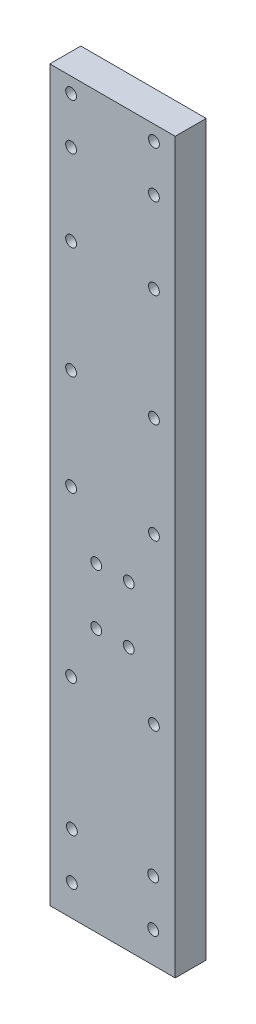
ISO-10303-21;
HEADER;
FILE_DESCRIPTION(('STEP AP214'),'2;1');
FILE_NAME('part.step','',(''),(''),'','','');
FILE_SCHEMA(('AUTOMOTIVE_DESIGN { 1 0 10303 214 1 1 1 1 }'));
ENDSEC;
DATA;
#1=APPLICATION_CONTEXT('core data for automotive mechanical design processes');
#2=APPLICATION_PROTOCOL_DEFINITION('international standard','automotive_design',2000,#1);
#3=PRODUCT_CONTEXT('',#1,'mechanical');
#4=PRODUCT('Part','Part','',(#3));
#5=PRODUCT_RELATED_PRODUCT_CATEGORY('part','',(#4));
#6=PRODUCT_DEFINITION_FORMATION('','',#4);
#7=PRODUCT_DEFINITION_CONTEXT('part definition',#1,'design');
#8=PRODUCT_DEFINITION('design','',#6,#7);
#9=PRODUCT_DEFINITION_SHAPE('','',#8);
#10=(LENGTH_UNIT() NAMED_UNIT(*) SI_UNIT(.MILLI.,.METRE.));
#11=(NAMED_UNIT(*) PLANE_ANGLE_UNIT() SI_UNIT($,.RADIAN.));
#12=(NAMED_UNIT(*) SI_UNIT($,.STERADIAN.) SOLID_ANGLE_UNIT());
#13=UNCERTAINTY_MEASURE_WITH_UNIT(LENGTH_MEASURE(1.E-05),#10,'distance_accuracy_value','');
#14=(GEOMETRIC_REPRESENTATION_CONTEXT(3) GLOBAL_UNCERTAINTY_ASSIGNED_CONTEXT((#13)) GLOBAL_UNIT_ASSIGNED_CONTEXT((#10,
#11,#12)) REPRESENTATION_CONTEXT('',''));
#15=CARTESIAN_POINT('',(0.,0.,0.));
#16=DIRECTION('',(0.,0.,1.));
#17=DIRECTION('',(1.,0.,0.));
#18=AXIS2_PLACEMENT_3D('',#15,#16,#17);
#19=CARTESIAN_POINT('',(0.,0.,4.));
#20=DIRECTION('',(0.,0.,-1.));
#21=DIRECTION('',(-1.,0.,0.));
#22=AXIS2_PLACEMENT_3D('',#19,#20,#21);
#23=PLANE('',#22);
#24=CARTESIAN_POINT('',(2.7500000000009,92.0614488310554,4.));
#25=DIRECTION('',(0.,0.,1.));
#26=DIRECTION('',(-1.,0.,0.));
#27=AXIS2_PLACEMENT_3D('',#24,#25,#26);
#28=CIRCLE('',#27,0.700000000000009);
#29=CARTESIAN_POINT('',(2.05000000000089,92.0614488310554,4.));
#30=VERTEX_POINT('',#29);
#31=EDGE_CURVE('E217',#30,#30,#28,.T.);
#32=ORIENTED_EDGE('',*,*,#31,.F.);
#33=EDGE_LOOP('',(#32));
#34=FACE_BOUND('',#33,.T.);
#35=CARTESIAN_POINT('',(13.4500000000022,86.0614488310554,4.));
#36=DIRECTION('',(0.,0.,1.));
#37=DIRECTION('',(1.,0.,0.));
#38=AXIS2_PLACEMENT_3D('',#35,#36,#37);
#39=CIRCLE('',#38,0.70000000000001);
#40=CARTESIAN_POINT('',(14.1500000000022,86.0614488310554,4.));
#41=VERTEX_POINT('',#40);
#42=EDGE_CURVE('E205',#41,#41,#39,.T.);
#43=ORIENTED_EDGE('',*,*,#42,.F.);
#44=EDGE_LOOP('',(#43));
#45=FACE_BOUND('',#44,.T.);
#46=CARTESIAN_POINT('',(13.4500000000001,75.5614488310554,4.));
#47=DIRECTION('',(0.,0.,1.));
#48=DIRECTION('',(1.,0.,0.));
#49=AXIS2_PLACEMENT_3D('',#46,#47,#48);
#50=CIRCLE('',#49,0.70000000000001);
#51=CARTESIAN_POINT('',(14.1500000000001,75.5614488310554,4.));
#52=VERTEX_POINT('',#51);
#53=EDGE_CURVE('E193',#52,#52,#50,.T.);
#54=ORIENTED_EDGE('',*,*,#53,.F.);
#55=EDGE_LOOP('',(#54));
#56=FACE_BOUND('',#55,.T.);
#57=CARTESIAN_POINT('',(13.350000000001,3.84644883105539,4.));
#58=DIRECTION('',(0.,0.,1.));
#59=DIRECTION('',(-1.,0.,0.));
#60=AXIS2_PLACEMENT_3D('',#57,#58,#59);
#61=CIRCLE('',#60,0.7);
#62=CARTESIAN_POINT('',(12.650000000001,3.84644883105539,4.));
#63=VERTEX_POINT('',#62);
#64=EDGE_CURVE('E181',#63,#63,#61,.T.);
#65=ORIENTED_EDGE('',*,*,#64,.F.);
#66=EDGE_LOOP('',(#65));
#67=FACE_BOUND('',#66,.T.);
#68=CARTESIAN_POINT('',(2.84999999999999,3.84644883105539,4.));
#69=DIRECTION('',(0.,0.,1.));
#70=DIRECTION('',(1.,0.,0.));
#71=AXIS2_PLACEMENT_3D('',#68,#69,#70);
#72=CIRCLE('',#71,0.7);
#73=CARTESIAN_POINT('',(3.54999999999999,3.84644883105539,4.));
#74=VERTEX_POINT('',#73);
#75=EDGE_CURVE('E169',#74,#74,#72,.T.);
#76=ORIENTED_EDGE('',*,*,#75,.F.);
#77=EDGE_LOOP('',(#76));
#78=FACE_BOUND('',#77,.T.);
#79=CARTESIAN_POINT('',(2.85,9.84644883105539,4.));
#80=DIRECTION('',(0.,0.,1.));
#81=DIRECTION('',(1.,0.,0.));
#82=AXIS2_PLACEMENT_3D('',#79,#80,#81);
#83=CIRCLE('',#82,0.7);
#84=CARTESIAN_POINT('',(3.55,9.84644883105539,4.));
#85=VERTEX_POINT('',#84);
#86=EDGE_CURVE('E157',#85,#85,#83,.T.);
#87=ORIENTED_EDGE('',*,*,#86,.F.);
#88=EDGE_LOOP('',(#87));
#89=FACE_BOUND('',#88,.T.);
#90=CARTESIAN_POINT('',(13.4500000000001,48.1064488310554,4.));
#91=DIRECTION('',(0.,0.,1.));
#92=DIRECTION('',(1.,0.,0.));
#93=AXIS2_PLACEMENT_3D('',#90,#91,#92);
#94=CIRCLE('',#93,0.699999999999999);
#95=CARTESIAN_POINT('',(14.1500000000001,48.1064488310554,4.));
#96=VERTEX_POINT('',#95);
#97=EDGE_CURVE('E145',#96,#96,#94,.T.);
#98=ORIENTED_EDGE('',*,*,#97,.F.);
#99=EDGE_LOOP('',(#98));
#100=FACE_BOUND('',#99,.T.);
#101=CARTESIAN_POINT('',(13.4500000000001,26.8464488310553,4.));
#102=DIRECTION('',(0.,0.,1.));
#103=DIRECTION('',(1.,0.,0.));
#104=AXIS2_PLACEMENT_3D('',#101,#102,#103);
#105=CIRCLE('',#104,0.699999999999999);
#106=CARTESIAN_POINT('',(14.1500000000001,26.8464488310553,4.));
#107=VERTEX_POINT('',#106);
#108=EDGE_CURVE('E133',#107,#107,#105,.T.);
#109=ORIENTED_EDGE('',*,*,#108,.F.);
#110=EDGE_LOOP('',(#109));
#111=FACE_BOUND('',#110,.T.);
#112=CARTESIAN_POINT('',(10.2000000000001,33.846448831055,4.));
#113=DIRECTION('',(0.,0.,1.));
#114=DIRECTION('',(1.,0.,0.));
#115=AXIS2_PLACEMENT_3D('',#112,#113,#114);
#116=CIRCLE('',#115,0.699999999999999);
#117=CARTESIAN_POINT('',(10.9000000000001,33.846448831055,4.));
#118=VERTEX_POINT('',#117);
#119=EDGE_CURVE('E121',#118,#118,#116,.T.);
#120=ORIENTED_EDGE('',*,*,#119,.F.);
#121=EDGE_LOOP('',(#120));
#122=FACE_BOUND('',#121,.T.);
#123=CARTESIAN_POINT('',(10.2000000000001,41.1664488310547,4.));
#124=DIRECTION('',(0.,0.,1.));
#125=DIRECTION('',(1.,0.,0.));
#126=AXIS2_PLACEMENT_3D('',#123,#124,#125);
#127=CIRCLE('',#126,0.699999999999999);
#128=CARTESIAN_POINT('',(10.9000000000001,41.1664488310547,4.));
#129=VERTEX_POINT('',#128);
#130=EDGE_CURVE('E100',#129,#129,#127,.T.);
#131=ORIENTED_EDGE('',*,*,#130,.F.);
#132=EDGE_LOOP('',(#131));
#133=FACE_BOUND('',#132,.T.);
#134=DIRECTION('',(1.,0.,0.));
#135=VECTOR('',#134,1.);
#136=CARTESIAN_POINT('',(0.,-0.15355116894461,4.));
#137=LINE('',#136,#135);
#138=CARTESIAN_POINT('',(0.,-0.15355116894461,4.));
#139=VERTEX_POINT('',#138);
#140=CARTESIAN_POINT('',(16.2,-0.15355116894461,4.));
#141=VERTEX_POINT('',#140);
#142=EDGE_CURVE('E85',#139,#141,#137,.T.);
#143=ORIENTED_EDGE('',*,*,#142,.T.);
#144=DIRECTION('',(0.,1.,0.));
#145=VECTOR('',#144,1.);
#146=CARTESIAN_POINT('',(16.2,94.0064488310554,4.));
#147=LINE('',#146,#145);
#148=CARTESIAN_POINT('',(16.2,94.0064488310554,4.));
#149=VERTEX_POINT('',#148);
#150=EDGE_CURVE('E80',#141,#149,#147,.T.);
#151=ORIENTED_EDGE('',*,*,#150,.T.);
#152=DIRECTION('',(-1.,0.,0.));
#153=VECTOR('',#152,1.);
#154=CARTESIAN_POINT('',(0.,94.0064488310554,4.));
#155=LINE('',#154,#153);
#156=CARTESIAN_POINT('',(0.,94.0064488310554,4.));
#157=VERTEX_POINT('',#156);
#158=EDGE_CURVE('E83',#149,#157,#155,.T.);
#159=ORIENTED_EDGE('',*,*,#158,.T.);
#160=DIRECTION('',(0.,-1.,0.));
#161=VECTOR('',#160,1.);
#162=CARTESIAN_POINT('',(0.,94.0064488310554,4.));
#163=LINE('',#162,#161);
#164=EDGE_CURVE('E50',#157,#139,#163,.T.);
#165=ORIENTED_EDGE('',*,*,#164,.T.);
#166=EDGE_LOOP('',(#143,#151,#159,#165));
#167=FACE_BOUND('',#166,.T.);
#168=CARTESIAN_POINT('',(6.,41.1064488310554,4.));
#169=DIRECTION('',(0.,0.,1.));
#170=DIRECTION('',(1.,0.,0.));
#171=AXIS2_PLACEMENT_3D('',#168,#169,#170);
#172=CIRCLE('',#171,0.699999999999999);
#173=CARTESIAN_POINT('',(6.7,41.1064488310554,4.));
#174=VERTEX_POINT('',#173);
#175=EDGE_CURVE('E115',#174,#174,#172,.T.);
#176=ORIENTED_EDGE('',*,*,#175,.F.);
#177=EDGE_LOOP('',(#176));
#178=FACE_BOUND('',#177,.T.);
#179=CARTESIAN_POINT('',(6.,33.846448831055,4.));
#180=DIRECTION('',(0.,0.,1.));
#181=DIRECTION('',(1.,0.,0.));
#182=AXIS2_PLACEMENT_3D('',#179,#180,#181);
#183=CIRCLE('',#182,0.7);
#184=CARTESIAN_POINT('',(6.7,33.846448831055,4.));
#185=VERTEX_POINT('',#184);
#186=EDGE_CURVE('E127',#185,#185,#183,.T.);
#187=ORIENTED_EDGE('',*,*,#186,.F.);
#188=EDGE_LOOP('',(#187));
#189=FACE_BOUND('',#188,.T.);
#190=CARTESIAN_POINT('',(2.75000000000002,26.8464488310555,4.));
#191=DIRECTION('',(0.,0.,1.));
#192=DIRECTION('',(1.,0.,0.));
#193=AXIS2_PLACEMENT_3D('',#190,#191,#192);
#194=CIRCLE('',#193,0.7);
#195=CARTESIAN_POINT('',(3.45000000000002,26.8464488310555,4.));
#196=VERTEX_POINT('',#195);
#197=EDGE_CURVE('E139',#196,#196,#194,.T.);
#198=ORIENTED_EDGE('',*,*,#197,.F.);
#199=EDGE_LOOP('',(#198));
#200=FACE_BOUND('',#199,.T.);
#201=CARTESIAN_POINT('',(2.75000000000002,48.1064488310554,4.));
#202=DIRECTION('',(0.,0.,1.));
#203=DIRECTION('',(1.,0.,0.));
#204=AXIS2_PLACEMENT_3D('',#201,#202,#203);
#205=CIRCLE('',#204,0.699999999999999);
#206=CARTESIAN_POINT('',(3.45000000000002,48.1064488310554,4.));
#207=VERTEX_POINT('',#206);
#208=EDGE_CURVE('E151',#207,#207,#205,.T.);
#209=ORIENTED_EDGE('',*,*,#208,.F.);
#210=EDGE_LOOP('',(#209));
#211=FACE_BOUND('',#210,.T.);
#212=CARTESIAN_POINT('',(13.4500000000016,61.1064488310554,4.));
#213=DIRECTION('',(0.,0.,1.));
#214=DIRECTION('',(1.,0.,0.));
#215=AXIS2_PLACEMENT_3D('',#212,#213,#214);
#216=CIRCLE('',#215,0.700000000000004);
#217=CARTESIAN_POINT('',(14.1500000000016,61.1064488310554,4.));
#218=VERTEX_POINT('',#217);
#219=EDGE_CURVE('E163',#218,#218,#216,.T.);
#220=ORIENTED_EDGE('',*,*,#219,.F.);
#221=EDGE_LOOP('',(#220));
#222=FACE_BOUND('',#221,.T.);
#223=CARTESIAN_POINT('',(13.350000000001,9.84644883105539,4.));
#224=DIRECTION('',(0.,0.,1.));
#225=DIRECTION('',(-1.,0.,0.));
#226=AXIS2_PLACEMENT_3D('',#223,#224,#225);
#227=CIRCLE('',#226,0.699999999999999);
#228=CARTESIAN_POINT('',(12.650000000001,9.84644883105539,4.));
#229=VERTEX_POINT('',#228);
#230=EDGE_CURVE('E175',#229,#229,#227,.T.);
#231=ORIENTED_EDGE('',*,*,#230,.F.);
#232=EDGE_LOOP('',(#231));
#233=FACE_BOUND('',#232,.T.);
#234=CARTESIAN_POINT('',(2.75000000000136,61.1064488310554,4.));
#235=DIRECTION('',(0.,0.,1.));
#236=DIRECTION('',(1.,0.,0.));
#237=AXIS2_PLACEMENT_3D('',#234,#235,#236);
#238=CIRCLE('',#237,0.700000000000004);
#239=CARTESIAN_POINT('',(3.45000000000136,61.1064488310554,4.));
#240=VERTEX_POINT('',#239);
#241=EDGE_CURVE('E187',#240,#240,#238,.T.);
#242=ORIENTED_EDGE('',*,*,#241,.F.);
#243=EDGE_LOOP('',(#242));
#244=FACE_BOUND('',#243,.T.);
#245=CARTESIAN_POINT('',(2.75000000000002,75.5614488310554,4.));
#246=DIRECTION('',(0.,0.,1.));
#247=DIRECTION('',(1.,0.,0.));
#248=AXIS2_PLACEMENT_3D('',#245,#246,#247);
#249=CIRCLE('',#248,0.700000000000009);
#250=CARTESIAN_POINT('',(3.45000000000003,75.5614488310554,4.));
#251=VERTEX_POINT('',#250);
#252=EDGE_CURVE('E199',#251,#251,#249,.T.);
#253=ORIENTED_EDGE('',*,*,#252,.F.);
#254=EDGE_LOOP('',(#253));
#255=FACE_BOUND('',#254,.T.);
#256=CARTESIAN_POINT('',(2.7500000000009,86.0614488310554,4.));
#257=DIRECTION('',(0.,0.,1.));
#258=DIRECTION('',(1.,0.,0.));
#259=AXIS2_PLACEMENT_3D('',#256,#257,#258);
#260=CIRCLE('',#259,0.700000000000009);
#261=CARTESIAN_POINT('',(3.45000000000091,86.0614488310554,4.));
#262=VERTEX_POINT('',#261);
#263=EDGE_CURVE('E211',#262,#262,#260,.T.);
#264=ORIENTED_EDGE('',*,*,#263,.F.);
#265=EDGE_LOOP('',(#264));
#266=FACE_BOUND('',#265,.T.);
#267=CARTESIAN_POINT('',(13.4500000000022,92.0614488310554,4.));
#268=DIRECTION('',(0.,0.,1.));
#269=DIRECTION('',(-1.,0.,0.));
#270=AXIS2_PLACEMENT_3D('',#267,#268,#269);
#271=CIRCLE('',#270,0.70000000000001);
#272=CARTESIAN_POINT('',(12.7500000000022,92.0614488310554,4.));
#273=VERTEX_POINT('',#272);
#274=EDGE_CURVE('E223',#273,#273,#271,.T.);
#275=ORIENTED_EDGE('',*,*,#274,.F.);
#276=EDGE_LOOP('',(#275));
#277=FACE_BOUND('',#276,.T.);
#278=ADVANCED_FACE('F33',(#34,#45,#56,#67,#78,#89,#100,#111,#122,#133,#167,#178,#189,#200,#211,
#222,#233,#244,#255,#266,#277),#23,.F.);
#279=CARTESIAN_POINT('',(0.,0.,0.));
#280=DIRECTION('',(0.,0.,-1.));
#281=DIRECTION('',(-1.,0.,0.));
#282=AXIS2_PLACEMENT_3D('',#279,#280,#281);
#283=PLANE('',#282);
#284=CARTESIAN_POINT('',(2.7500000000009,92.0614488310554,0.));
#285=DIRECTION('',(0.,0.,1.));
#286=DIRECTION('',(-1.,0.,0.));
#287=AXIS2_PLACEMENT_3D('',#284,#285,#286);
#288=CIRCLE('',#287,0.700000000000009);
#289=CARTESIAN_POINT('',(2.05000000000089,92.0614488310554,0.));
#290=VERTEX_POINT('',#289);
#291=EDGE_CURVE('E220',#290,#290,#288,.T.);
#292=ORIENTED_EDGE('',*,*,#291,.T.);
#293=EDGE_LOOP('',(#292));
#294=FACE_BOUND('',#293,.T.);
#295=CARTESIAN_POINT('',(13.4500000000022,86.0614488310554,0.));
#296=DIRECTION('',(0.,0.,1.));
#297=DIRECTION('',(1.,0.,0.));
#298=AXIS2_PLACEMENT_3D('',#295,#296,#297);
#299=CIRCLE('',#298,0.70000000000001);
#300=CARTESIAN_POINT('',(14.1500000000022,86.0614488310554,0.));
#301=VERTEX_POINT('',#300);
#302=EDGE_CURVE('E208',#301,#301,#299,.T.);
#303=ORIENTED_EDGE('',*,*,#302,.T.);
#304=EDGE_LOOP('',(#303));
#305=FACE_BOUND('',#304,.T.);
#306=CARTESIAN_POINT('',(13.4500000000001,75.5614488310554,0.));
#307=DIRECTION('',(0.,0.,1.));
#308=DIRECTION('',(1.,0.,0.));
#309=AXIS2_PLACEMENT_3D('',#306,#307,#308);
#310=CIRCLE('',#309,0.70000000000001);
#311=CARTESIAN_POINT('',(14.1500000000001,75.5614488310554,0.));
#312=VERTEX_POINT('',#311);
#313=EDGE_CURVE('E196',#312,#312,#310,.T.);
#314=ORIENTED_EDGE('',*,*,#313,.T.);
#315=EDGE_LOOP('',(#314));
#316=FACE_BOUND('',#315,.T.);
#317=CARTESIAN_POINT('',(13.350000000001,3.84644883105539,0.));
#318=DIRECTION('',(0.,0.,1.));
#319=DIRECTION('',(-1.,0.,0.));
#320=AXIS2_PLACEMENT_3D('',#317,#318,#319);
#321=CIRCLE('',#320,0.7);
#322=CARTESIAN_POINT('',(12.650000000001,3.84644883105539,0.));
#323=VERTEX_POINT('',#322);
#324=EDGE_CURVE('E184',#323,#323,#321,.T.);
#325=ORIENTED_EDGE('',*,*,#324,.T.);
#326=EDGE_LOOP('',(#325));
#327=FACE_BOUND('',#326,.T.);
#328=CARTESIAN_POINT('',(2.84999999999999,3.84644883105539,0.));
#329=DIRECTION('',(0.,0.,1.));
#330=DIRECTION('',(1.,0.,0.));
#331=AXIS2_PLACEMENT_3D('',#328,#329,#330);
#332=CIRCLE('',#331,0.7);
#333=CARTESIAN_POINT('',(3.54999999999999,3.84644883105539,0.));
#334=VERTEX_POINT('',#333);
#335=EDGE_CURVE('E172',#334,#334,#332,.T.);
#336=ORIENTED_EDGE('',*,*,#335,.T.);
#337=EDGE_LOOP('',(#336));
#338=FACE_BOUND('',#337,.T.);
#339=CARTESIAN_POINT('',(2.85,9.84644883105539,0.));
#340=DIRECTION('',(0.,0.,1.));
#341=DIRECTION('',(1.,0.,0.));
#342=AXIS2_PLACEMENT_3D('',#339,#340,#341);
#343=CIRCLE('',#342,0.7);
#344=CARTESIAN_POINT('',(3.55,9.84644883105539,0.));
#345=VERTEX_POINT('',#344);
#346=EDGE_CURVE('E160',#345,#345,#343,.T.);
#347=ORIENTED_EDGE('',*,*,#346,.T.);
#348=EDGE_LOOP('',(#347));
#349=FACE_BOUND('',#348,.T.);
#350=CARTESIAN_POINT('',(13.4500000000001,48.1064488310554,0.));
#351=DIRECTION('',(0.,0.,1.));
#352=DIRECTION('',(1.,0.,0.));
#353=AXIS2_PLACEMENT_3D('',#350,#351,#352);
#354=CIRCLE('',#353,0.699999999999999);
#355=CARTESIAN_POINT('',(14.1500000000001,48.1064488310554,0.));
#356=VERTEX_POINT('',#355);
#357=EDGE_CURVE('E148',#356,#356,#354,.T.);
#358=ORIENTED_EDGE('',*,*,#357,.T.);
#359=EDGE_LOOP('',(#358));
#360=FACE_BOUND('',#359,.T.);
#361=CARTESIAN_POINT('',(13.4500000000001,26.8464488310553,0.));
#362=DIRECTION('',(0.,0.,1.));
#363=DIRECTION('',(1.,0.,0.));
#364=AXIS2_PLACEMENT_3D('',#361,#362,#363);
#365=CIRCLE('',#364,0.699999999999999);
#366=CARTESIAN_POINT('',(14.1500000000001,26.8464488310553,0.));
#367=VERTEX_POINT('',#366);
#368=EDGE_CURVE('E136',#367,#367,#365,.T.);
#369=ORIENTED_EDGE('',*,*,#368,.T.);
#370=EDGE_LOOP('',(#369));
#371=FACE_BOUND('',#370,.T.);
#372=CARTESIAN_POINT('',(10.2000000000001,33.846448831055,0.));
#373=DIRECTION('',(0.,0.,1.));
#374=DIRECTION('',(1.,0.,0.));
#375=AXIS2_PLACEMENT_3D('',#372,#373,#374);
#376=CIRCLE('',#375,0.699999999999999);
#377=CARTESIAN_POINT('',(10.9000000000001,33.846448831055,0.));
#378=VERTEX_POINT('',#377);
#379=EDGE_CURVE('E124',#378,#378,#376,.T.);
#380=ORIENTED_EDGE('',*,*,#379,.T.);
#381=EDGE_LOOP('',(#380));
#382=FACE_BOUND('',#381,.T.);
#383=CARTESIAN_POINT('',(10.2000000000001,41.1664488310547,0.));
#384=DIRECTION('',(0.,0.,1.));
#385=DIRECTION('',(1.,0.,0.));
#386=AXIS2_PLACEMENT_3D('',#383,#384,#385);
#387=CIRCLE('',#386,0.699999999999999);
#388=CARTESIAN_POINT('',(10.9000000000001,41.1664488310547,0.));
#389=VERTEX_POINT('',#388);
#390=EDGE_CURVE('E112',#389,#389,#387,.T.);
#391=ORIENTED_EDGE('',*,*,#390,.T.);
#392=EDGE_LOOP('',(#391));
#393=FACE_BOUND('',#392,.T.);
#394=DIRECTION('',(1.,0.,0.));
#395=VECTOR('',#394,1.);
#396=CARTESIAN_POINT('',(0.,-0.15355116894461,0.));
#397=LINE('',#396,#395);
#398=CARTESIAN_POINT('',(0.,-0.15355116894461,0.));
#399=VERTEX_POINT('',#398);
#400=CARTESIAN_POINT('',(16.2,-0.15355116894461,0.));
#401=VERTEX_POINT('',#400);
#402=EDGE_CURVE('E97',#399,#401,#397,.T.);
#403=ORIENTED_EDGE('',*,*,#402,.F.);
#404=DIRECTION('',(0.,-1.,0.));
#405=VECTOR('',#404,1.);
#406=CARTESIAN_POINT('',(0.,94.0064488310554,0.));
#407=LINE('',#406,#405);
#408=CARTESIAN_POINT('',(0.,94.0064488310554,0.));
#409=VERTEX_POINT('',#408);
#410=EDGE_CURVE('E73',#409,#399,#407,.T.);
#411=ORIENTED_EDGE('',*,*,#410,.F.);
#412=DIRECTION('',(-1.,0.,0.));
#413=VECTOR('',#412,1.);
#414=CARTESIAN_POINT('',(0.,94.0064488310554,0.));
#415=LINE('',#414,#413);
#416=CARTESIAN_POINT('',(16.2,94.0064488310554,0.));
#417=VERTEX_POINT('',#416);
#418=EDGE_CURVE('E67',#417,#409,#415,.T.);
#419=ORIENTED_EDGE('',*,*,#418,.F.);
#420=DIRECTION('',(0.,1.,0.));
#421=VECTOR('',#420,1.);
#422=CARTESIAN_POINT('',(16.2,94.0064488310554,0.));
#423=LINE('',#422,#421);
#424=EDGE_CURVE('E89',#401,#417,#423,.T.);
#425=ORIENTED_EDGE('',*,*,#424,.F.);
#426=EDGE_LOOP('',(#403,#411,#419,#425));
#427=FACE_BOUND('',#426,.T.);
#428=CARTESIAN_POINT('',(6.,41.1064488310554,0.));
#429=DIRECTION('',(0.,0.,1.));
#430=DIRECTION('',(1.,0.,0.));
#431=AXIS2_PLACEMENT_3D('',#428,#429,#430);
#432=CIRCLE('',#431,0.699999999999999);
#433=CARTESIAN_POINT('',(6.7,41.1064488310554,0.));
#434=VERTEX_POINT('',#433);
#435=EDGE_CURVE('E118',#434,#434,#432,.T.);
#436=ORIENTED_EDGE('',*,*,#435,.T.);
#437=EDGE_LOOP('',(#436));
#438=FACE_BOUND('',#437,.T.);
#439=CARTESIAN_POINT('',(6.,33.846448831055,0.));
#440=DIRECTION('',(0.,0.,1.));
#441=DIRECTION('',(1.,0.,0.));
#442=AXIS2_PLACEMENT_3D('',#439,#440,#441);
#443=CIRCLE('',#442,0.7);
#444=CARTESIAN_POINT('',(6.7,33.846448831055,0.));
#445=VERTEX_POINT('',#444);
#446=EDGE_CURVE('E130',#445,#445,#443,.T.);
#447=ORIENTED_EDGE('',*,*,#446,.T.);
#448=EDGE_LOOP('',(#447));
#449=FACE_BOUND('',#448,.T.);
#450=CARTESIAN_POINT('',(2.75000000000002,26.8464488310555,0.));
#451=DIRECTION('',(0.,0.,1.));
#452=DIRECTION('',(1.,0.,0.));
#453=AXIS2_PLACEMENT_3D('',#450,#451,#452);
#454=CIRCLE('',#453,0.7);
#455=CARTESIAN_POINT('',(3.45000000000002,26.8464488310555,0.));
#456=VERTEX_POINT('',#455);
#457=EDGE_CURVE('E142',#456,#456,#454,.T.);
#458=ORIENTED_EDGE('',*,*,#457,.T.);
#459=EDGE_LOOP('',(#458));
#460=FACE_BOUND('',#459,.T.);
#461=CARTESIAN_POINT('',(2.75000000000002,48.1064488310554,0.));
#462=DIRECTION('',(0.,0.,1.));
#463=DIRECTION('',(1.,0.,0.));
#464=AXIS2_PLACEMENT_3D('',#461,#462,#463);
#465=CIRCLE('',#464,0.699999999999999);
#466=CARTESIAN_POINT('',(3.45000000000002,48.1064488310554,0.));
#467=VERTEX_POINT('',#466);
#468=EDGE_CURVE('E154',#467,#467,#465,.T.);
#469=ORIENTED_EDGE('',*,*,#468,.T.);
#470=EDGE_LOOP('',(#469));
#471=FACE_BOUND('',#470,.T.);
#472=CARTESIAN_POINT('',(13.4500000000016,61.1064488310554,0.));
#473=DIRECTION('',(0.,0.,1.));
#474=DIRECTION('',(1.,0.,0.));
#475=AXIS2_PLACEMENT_3D('',#472,#473,#474);
#476=CIRCLE('',#475,0.700000000000004);
#477=CARTESIAN_POINT('',(14.1500000000016,61.1064488310554,0.));
#478=VERTEX_POINT('',#477);
#479=EDGE_CURVE('E166',#478,#478,#476,.T.);
#480=ORIENTED_EDGE('',*,*,#479,.T.);
#481=EDGE_LOOP('',(#480));
#482=FACE_BOUND('',#481,.T.);
#483=CARTESIAN_POINT('',(13.350000000001,9.84644883105539,0.));
#484=DIRECTION('',(0.,0.,1.));
#485=DIRECTION('',(-1.,0.,0.));
#486=AXIS2_PLACEMENT_3D('',#483,#484,#485);
#487=CIRCLE('',#486,0.699999999999999);
#488=CARTESIAN_POINT('',(12.650000000001,9.84644883105539,0.));
#489=VERTEX_POINT('',#488);
#490=EDGE_CURVE('E178',#489,#489,#487,.T.);
#491=ORIENTED_EDGE('',*,*,#490,.T.);
#492=EDGE_LOOP('',(#491));
#493=FACE_BOUND('',#492,.T.);
#494=CARTESIAN_POINT('',(2.75000000000136,61.1064488310554,0.));
#495=DIRECTION('',(0.,0.,1.));
#496=DIRECTION('',(1.,0.,0.));
#497=AXIS2_PLACEMENT_3D('',#494,#495,#496);
#498=CIRCLE('',#497,0.700000000000004);
#499=CARTESIAN_POINT('',(3.45000000000136,61.1064488310554,0.));
#500=VERTEX_POINT('',#499);
#501=EDGE_CURVE('E190',#500,#500,#498,.T.);
#502=ORIENTED_EDGE('',*,*,#501,.T.);
#503=EDGE_LOOP('',(#502));
#504=FACE_BOUND('',#503,.T.);
#505=CARTESIAN_POINT('',(2.75000000000002,75.5614488310554,0.));
#506=DIRECTION('',(0.,0.,1.));
#507=DIRECTION('',(1.,0.,0.));
#508=AXIS2_PLACEMENT_3D('',#505,#506,#507);
#509=CIRCLE('',#508,0.700000000000009);
#510=CARTESIAN_POINT('',(3.45000000000003,75.5614488310554,0.));
#511=VERTEX_POINT('',#510);
#512=EDGE_CURVE('E202',#511,#511,#509,.T.);
#513=ORIENTED_EDGE('',*,*,#512,.T.);
#514=EDGE_LOOP('',(#513));
#515=FACE_BOUND('',#514,.T.);
#516=CARTESIAN_POINT('',(2.7500000000009,86.0614488310554,0.));
#517=DIRECTION('',(0.,0.,1.));
#518=DIRECTION('',(1.,0.,0.));
#519=AXIS2_PLACEMENT_3D('',#516,#517,#518);
#520=CIRCLE('',#519,0.700000000000009);
#521=CARTESIAN_POINT('',(3.45000000000091,86.0614488310554,0.));
#522=VERTEX_POINT('',#521);
#523=EDGE_CURVE('E214',#522,#522,#520,.T.);
#524=ORIENTED_EDGE('',*,*,#523,.T.);
#525=EDGE_LOOP('',(#524));
#526=FACE_BOUND('',#525,.T.);
#527=CARTESIAN_POINT('',(13.4500000000022,92.0614488310554,0.));
#528=DIRECTION('',(0.,0.,1.));
#529=DIRECTION('',(-1.,0.,0.));
#530=AXIS2_PLACEMENT_3D('',#527,#528,#529);
#531=CIRCLE('',#530,0.70000000000001);
#532=CARTESIAN_POINT('',(12.7500000000022,92.0614488310554,0.));
#533=VERTEX_POINT('',#532);
#534=EDGE_CURVE('E226',#533,#533,#531,.T.);
#535=ORIENTED_EDGE('',*,*,#534,.T.);
#536=EDGE_LOOP('',(#535));
#537=FACE_BOUND('',#536,.T.);
#538=ADVANCED_FACE('F108',(#294,#305,#316,#327,#338,#349,#360,#371,#382,#393,#427,#438,#449,
#460,#471,#482,#493,#504,#515,#526,#537),#283,.T.);
#539=CARTESIAN_POINT('',(0.,-0.15355116894461,4.));
#540=DIRECTION('',(0.,1.,0.));
#541=DIRECTION('',(0.,0.,1.));
#542=AXIS2_PLACEMENT_3D('',#539,#540,#541);
#543=PLANE('',#542);
#544=ORIENTED_EDGE('',*,*,#402,.T.);
#545=DIRECTION('',(0.,0.,-1.));
#546=VECTOR('',#545,1.);
#547=CARTESIAN_POINT('',(16.2,-0.15355116894461,4.));
#548=LINE('',#547,#546);
#549=EDGE_CURVE('E11',#141,#401,#548,.T.);
#550=ORIENTED_EDGE('',*,*,#549,.F.);
#551=ORIENTED_EDGE('',*,*,#142,.F.);
#552=DIRECTION('',(0.,0.,-1.));
#553=VECTOR('',#552,1.);
#554=CARTESIAN_POINT('',(0.,-0.15355116894461,4.));
#555=LINE('',#554,#553);
#556=EDGE_CURVE('E93',#139,#399,#555,.T.);
#557=ORIENTED_EDGE('',*,*,#556,.T.);
#558=EDGE_LOOP('',(#544,#550,#551,#557));
#559=FACE_BOUND('',#558,.T.);
#560=ADVANCED_FACE('F35',(#559),#543,.F.);
#561=CARTESIAN_POINT('',(16.2,94.0064488310554,4.));
#562=DIRECTION('',(-1.,0.,0.));
#563=DIRECTION('',(0.,-1.,0.));
#564=AXIS2_PLACEMENT_3D('',#561,#562,#563);
#565=PLANE('',#564);
#566=ORIENTED_EDGE('',*,*,#424,.T.);
#567=DIRECTION('',(0.,0.,-1.));
#568=VECTOR('',#567,1.);
#569=CARTESIAN_POINT('',(16.2,94.0064488310554,4.));
#570=LINE('',#569,#568);
#571=EDGE_CURVE('E42',#149,#417,#570,.T.);
#572=ORIENTED_EDGE('',*,*,#571,.F.);
#573=ORIENTED_EDGE('',*,*,#150,.F.);
#574=ORIENTED_EDGE('',*,*,#549,.T.);
#575=EDGE_LOOP('',(#566,#572,#573,#574));
#576=FACE_BOUND('',#575,.T.);
#577=ADVANCED_FACE('F88',(#576),#565,.F.);
#578=CARTESIAN_POINT('',(0.,94.0064488310554,4.));
#579=DIRECTION('',(0.,-1.,0.));
#580=DIRECTION('',(0.,0.,-1.));
#581=AXIS2_PLACEMENT_3D('',#578,#579,#580);
#582=PLANE('',#581);
#583=ORIENTED_EDGE('',*,*,#418,.T.);
#584=DIRECTION('',(0.,0.,-1.));
#585=VECTOR('',#584,1.);
#586=CARTESIAN_POINT('',(0.,94.0064488310554,4.));
#587=LINE('',#586,#585);
#588=EDGE_CURVE('E90',#157,#409,#587,.T.);
#589=ORIENTED_EDGE('',*,*,#588,.F.);
#590=ORIENTED_EDGE('',*,*,#158,.F.);
#591=ORIENTED_EDGE('',*,*,#571,.T.);
#592=EDGE_LOOP('',(#583,#589,#590,#591));
#593=FACE_BOUND('',#592,.T.);
#594=ADVANCED_FACE('F91',(#593),#582,.F.);
#595=CARTESIAN_POINT('',(0.,94.0064488310554,4.));
#596=DIRECTION('',(1.,0.,0.));
#597=DIRECTION('',(0.,1.,0.));
#598=AXIS2_PLACEMENT_3D('',#595,#596,#597);
#599=PLANE('',#598);
#600=ORIENTED_EDGE('',*,*,#410,.T.);
#601=ORIENTED_EDGE('',*,*,#556,.F.);
#602=ORIENTED_EDGE('',*,*,#164,.F.);
#603=ORIENTED_EDGE('',*,*,#588,.T.);
#604=EDGE_LOOP('',(#600,#601,#602,#603));
#605=FACE_BOUND('',#604,.T.);
#606=ADVANCED_FACE('F105',(#605),#599,.F.);
#607=CARTESIAN_POINT('',(10.2000000000001,41.1664488310547,4.));
#608=DIRECTION('',(0.,0.,-1.));
#609=DIRECTION('',(-1.,0.,0.));
#610=AXIS2_PLACEMENT_3D('',#607,#608,#609);
#611=CYLINDRICAL_SURFACE('',#610,0.699999999999999);
#612=ORIENTED_EDGE('',*,*,#130,.T.);
#613=EDGE_LOOP('',(#612));
#614=FACE_BOUND('',#613,.T.);
#615=ORIENTED_EDGE('',*,*,#390,.F.);
#616=EDGE_LOOP('',(#615));
#617=FACE_BOUND('',#616,.T.);
#618=ADVANCED_FACE('F246',(#614,#617),#611,.F.);
#619=CARTESIAN_POINT('',(6.,41.1064488310554,4.));
#620=DIRECTION('',(0.,0.,-1.));
#621=DIRECTION('',(-1.,0.,0.));
#622=AXIS2_PLACEMENT_3D('',#619,#620,#621);
#623=CYLINDRICAL_SURFACE('',#622,0.699999999999999);
#624=ORIENTED_EDGE('',*,*,#175,.T.);
#625=EDGE_LOOP('',(#624));
#626=FACE_BOUND('',#625,.T.);
#627=ORIENTED_EDGE('',*,*,#435,.F.);
#628=EDGE_LOOP('',(#627));
#629=FACE_BOUND('',#628,.T.);
#630=ADVANCED_FACE('F292',(#626,#629),#623,.F.);
#631=CARTESIAN_POINT('',(10.2000000000001,33.846448831055,4.));
#632=DIRECTION('',(0.,0.,-1.));
#633=DIRECTION('',(-1.,0.,0.));
#634=AXIS2_PLACEMENT_3D('',#631,#632,#633);
#635=CYLINDRICAL_SURFACE('',#634,0.699999999999999);
#636=ORIENTED_EDGE('',*,*,#119,.T.);
#637=EDGE_LOOP('',(#636));
#638=FACE_BOUND('',#637,.T.);
#639=ORIENTED_EDGE('',*,*,#379,.F.);
#640=EDGE_LOOP('',(#639));
#641=FACE_BOUND('',#640,.T.);
#642=ADVANCED_FACE('F300',(#638,#641),#635,.F.);
#643=CARTESIAN_POINT('',(6.,33.846448831055,4.));
#644=DIRECTION('',(0.,0.,-1.));
#645=DIRECTION('',(-1.,0.,0.));
#646=AXIS2_PLACEMENT_3D('',#643,#644,#645);
#647=CYLINDRICAL_SURFACE('',#646,0.7);
#648=ORIENTED_EDGE('',*,*,#186,.T.);
#649=EDGE_LOOP('',(#648));
#650=FACE_BOUND('',#649,.T.);
#651=ORIENTED_EDGE('',*,*,#446,.F.);
#652=EDGE_LOOP('',(#651));
#653=FACE_BOUND('',#652,.T.);
#654=ADVANCED_FACE('F308',(#650,#653),#647,.F.);
#655=CARTESIAN_POINT('',(13.4500000000001,26.8464488310553,4.));
#656=DIRECTION('',(0.,0.,-1.));
#657=DIRECTION('',(-1.,0.,0.));
#658=AXIS2_PLACEMENT_3D('',#655,#656,#657);
#659=CYLINDRICAL_SURFACE('',#658,0.699999999999999);
#660=ORIENTED_EDGE('',*,*,#108,.T.);
#661=EDGE_LOOP('',(#660));
#662=FACE_BOUND('',#661,.T.);
#663=ORIENTED_EDGE('',*,*,#368,.F.);
#664=EDGE_LOOP('',(#663));
#665=FACE_BOUND('',#664,.T.);
#666=ADVANCED_FACE('F317',(#662,#665),#659,.F.);
#667=CARTESIAN_POINT('',(2.75000000000002,26.8464488310555,4.));
#668=DIRECTION('',(0.,0.,-1.));
#669=DIRECTION('',(-1.,0.,0.));
#670=AXIS2_PLACEMENT_3D('',#667,#668,#669);
#671=CYLINDRICAL_SURFACE('',#670,0.7);
#672=ORIENTED_EDGE('',*,*,#197,.T.);
#673=EDGE_LOOP('',(#672));
#674=FACE_BOUND('',#673,.T.);
#675=ORIENTED_EDGE('',*,*,#457,.F.);
#676=EDGE_LOOP('',(#675));
#677=FACE_BOUND('',#676,.T.);
#678=ADVANCED_FACE('F326',(#674,#677),#671,.F.);
#679=CARTESIAN_POINT('',(13.4500000000001,48.1064488310554,4.));
#680=DIRECTION('',(0.,0.,-1.));
#681=DIRECTION('',(-1.,0.,0.));
#682=AXIS2_PLACEMENT_3D('',#679,#680,#681);
#683=CYLINDRICAL_SURFACE('',#682,0.699999999999999);
#684=ORIENTED_EDGE('',*,*,#97,.T.);
#685=EDGE_LOOP('',(#684));
#686=FACE_BOUND('',#685,.T.);
#687=ORIENTED_EDGE('',*,*,#357,.F.);
#688=EDGE_LOOP('',(#687));
#689=FACE_BOUND('',#688,.T.);
#690=ADVANCED_FACE('F335',(#686,#689),#683,.F.);
#691=CARTESIAN_POINT('',(2.75000000000002,48.1064488310554,4.));
#692=DIRECTION('',(0.,0.,-1.));
#693=DIRECTION('',(-1.,0.,0.));
#694=AXIS2_PLACEMENT_3D('',#691,#692,#693);
#695=CYLINDRICAL_SURFACE('',#694,0.699999999999999);
#696=ORIENTED_EDGE('',*,*,#208,.T.);
#697=EDGE_LOOP('',(#696));
#698=FACE_BOUND('',#697,.T.);
#699=ORIENTED_EDGE('',*,*,#468,.F.);
#700=EDGE_LOOP('',(#699));
#701=FACE_BOUND('',#700,.T.);
#702=ADVANCED_FACE('F344',(#698,#701),#695,.F.);
#703=CARTESIAN_POINT('',(2.85,9.84644883105539,4.));
#704=DIRECTION('',(0.,0.,-1.));
#705=DIRECTION('',(-1.,0.,0.));
#706=AXIS2_PLACEMENT_3D('',#703,#704,#705);
#707=CYLINDRICAL_SURFACE('',#706,0.7);
#708=ORIENTED_EDGE('',*,*,#86,.T.);
#709=EDGE_LOOP('',(#708));
#710=FACE_BOUND('',#709,.T.);
#711=ORIENTED_EDGE('',*,*,#346,.F.);
#712=EDGE_LOOP('',(#711));
#713=FACE_BOUND('',#712,.T.);
#714=ADVANCED_FACE('F353',(#710,#713),#707,.F.);
#715=CARTESIAN_POINT('',(13.4500000000016,61.1064488310554,4.));
#716=DIRECTION('',(0.,0.,-1.));
#717=DIRECTION('',(-1.,0.,0.));
#718=AXIS2_PLACEMENT_3D('',#715,#716,#717);
#719=CYLINDRICAL_SURFACE('',#718,0.700000000000004);
#720=ORIENTED_EDGE('',*,*,#219,.T.);
#721=EDGE_LOOP('',(#720));
#722=FACE_BOUND('',#721,.T.);
#723=ORIENTED_EDGE('',*,*,#479,.F.);
#724=EDGE_LOOP('',(#723));
#725=FACE_BOUND('',#724,.T.);
#726=ADVANCED_FACE('F362',(#722,#725),#719,.F.);
#727=CARTESIAN_POINT('',(2.84999999999999,3.84644883105539,4.));
#728=DIRECTION('',(0.,0.,-1.));
#729=DIRECTION('',(-1.,0.,0.));
#730=AXIS2_PLACEMENT_3D('',#727,#728,#729);
#731=CYLINDRICAL_SURFACE('',#730,0.7);
#732=ORIENTED_EDGE('',*,*,#75,.T.);
#733=EDGE_LOOP('',(#732));
#734=FACE_BOUND('',#733,.T.);
#735=ORIENTED_EDGE('',*,*,#335,.F.);
#736=EDGE_LOOP('',(#735));
#737=FACE_BOUND('',#736,.T.);
#738=ADVANCED_FACE('F371',(#734,#737),#731,.F.);
#739=CARTESIAN_POINT('',(13.350000000001,9.84644883105539,4.));
#740=DIRECTION('',(0.,0.,-1.));
#741=DIRECTION('',(-1.,0.,0.));
#742=AXIS2_PLACEMENT_3D('',#739,#740,#741);
#743=CYLINDRICAL_SURFACE('',#742,0.699999999999999);
#744=ORIENTED_EDGE('',*,*,#230,.T.);
#745=EDGE_LOOP('',(#744));
#746=FACE_BOUND('',#745,.T.);
#747=ORIENTED_EDGE('',*,*,#490,.F.);
#748=EDGE_LOOP('',(#747));
#749=FACE_BOUND('',#748,.T.);
#750=ADVANCED_FACE('F380',(#746,#749),#743,.F.);
#751=CARTESIAN_POINT('',(13.350000000001,3.84644883105539,4.));
#752=DIRECTION('',(0.,0.,-1.));
#753=DIRECTION('',(-1.,0.,0.));
#754=AXIS2_PLACEMENT_3D('',#751,#752,#753);
#755=CYLINDRICAL_SURFACE('',#754,0.7);
#756=ORIENTED_EDGE('',*,*,#64,.T.);
#757=EDGE_LOOP('',(#756));
#758=FACE_BOUND('',#757,.T.);
#759=ORIENTED_EDGE('',*,*,#324,.F.);
#760=EDGE_LOOP('',(#759));
#761=FACE_BOUND('',#760,.T.);
#762=ADVANCED_FACE('F389',(#758,#761),#755,.F.);
#763=CARTESIAN_POINT('',(2.75000000000136,61.1064488310554,4.));
#764=DIRECTION('',(0.,0.,-1.));
#765=DIRECTION('',(-1.,0.,0.));
#766=AXIS2_PLACEMENT_3D('',#763,#764,#765);
#767=CYLINDRICAL_SURFACE('',#766,0.700000000000004);
#768=ORIENTED_EDGE('',*,*,#241,.T.);
#769=EDGE_LOOP('',(#768));
#770=FACE_BOUND('',#769,.T.);
#771=ORIENTED_EDGE('',*,*,#501,.F.);
#772=EDGE_LOOP('',(#771));
#773=FACE_BOUND('',#772,.T.);
#774=ADVANCED_FACE('F398',(#770,#773),#767,.F.);
#775=CARTESIAN_POINT('',(13.4500000000001,75.5614488310554,4.));
#776=DIRECTION('',(0.,0.,-1.));
#777=DIRECTION('',(-1.,0.,0.));
#778=AXIS2_PLACEMENT_3D('',#775,#776,#777);
#779=CYLINDRICAL_SURFACE('',#778,0.70000000000001);
#780=ORIENTED_EDGE('',*,*,#53,.T.);
#781=EDGE_LOOP('',(#780));
#782=FACE_BOUND('',#781,.T.);
#783=ORIENTED_EDGE('',*,*,#313,.F.);
#784=EDGE_LOOP('',(#783));
#785=FACE_BOUND('',#784,.T.);
#786=ADVANCED_FACE('F407',(#782,#785),#779,.F.);
#787=CARTESIAN_POINT('',(2.75000000000002,75.5614488310554,4.));
#788=DIRECTION('',(0.,0.,-1.));
#789=DIRECTION('',(-1.,0.,0.));
#790=AXIS2_PLACEMENT_3D('',#787,#788,#789);
#791=CYLINDRICAL_SURFACE('',#790,0.700000000000009);
#792=ORIENTED_EDGE('',*,*,#252,.T.);
#793=EDGE_LOOP('',(#792));
#794=FACE_BOUND('',#793,.T.);
#795=ORIENTED_EDGE('',*,*,#512,.F.);
#796=EDGE_LOOP('',(#795));
#797=FACE_BOUND('',#796,.T.);
#798=ADVANCED_FACE('F416',(#794,#797),#791,.F.);
#799=CARTESIAN_POINT('',(13.4500000000022,86.0614488310554,4.));
#800=DIRECTION('',(0.,0.,-1.));
#801=DIRECTION('',(-1.,0.,0.));
#802=AXIS2_PLACEMENT_3D('',#799,#800,#801);
#803=CYLINDRICAL_SURFACE('',#802,0.70000000000001);
#804=ORIENTED_EDGE('',*,*,#42,.T.);
#805=EDGE_LOOP('',(#804));
#806=FACE_BOUND('',#805,.T.);
#807=ORIENTED_EDGE('',*,*,#302,.F.);
#808=EDGE_LOOP('',(#807));
#809=FACE_BOUND('',#808,.T.);
#810=ADVANCED_FACE('F425',(#806,#809),#803,.F.);
#811=CARTESIAN_POINT('',(2.7500000000009,86.0614488310554,4.));
#812=DIRECTION('',(0.,0.,-1.));
#813=DIRECTION('',(-1.,0.,0.));
#814=AXIS2_PLACEMENT_3D('',#811,#812,#813);
#815=CYLINDRICAL_SURFACE('',#814,0.700000000000009);
#816=ORIENTED_EDGE('',*,*,#263,.T.);
#817=EDGE_LOOP('',(#816));
#818=FACE_BOUND('',#817,.T.);
#819=ORIENTED_EDGE('',*,*,#523,.F.);
#820=EDGE_LOOP('',(#819));
#821=FACE_BOUND('',#820,.T.);
#822=ADVANCED_FACE('F434',(#818,#821),#815,.F.);
#823=CARTESIAN_POINT('',(2.7500000000009,92.0614488310554,4.));
#824=DIRECTION('',(0.,0.,-1.));
#825=DIRECTION('',(-1.,0.,0.));
#826=AXIS2_PLACEMENT_3D('',#823,#824,#825);
#827=CYLINDRICAL_SURFACE('',#826,0.700000000000009);
#828=ORIENTED_EDGE('',*,*,#31,.T.);
#829=EDGE_LOOP('',(#828));
#830=FACE_BOUND('',#829,.T.);
#831=ORIENTED_EDGE('',*,*,#291,.F.);
#832=EDGE_LOOP('',(#831));
#833=FACE_BOUND('',#832,.T.);
#834=ADVANCED_FACE('F443',(#830,#833),#827,.F.);
#835=CARTESIAN_POINT('',(13.4500000000022,92.0614488310554,4.));
#836=DIRECTION('',(0.,0.,-1.));
#837=DIRECTION('',(-1.,0.,0.));
#838=AXIS2_PLACEMENT_3D('',#835,#836,#837);
#839=CYLINDRICAL_SURFACE('',#838,0.70000000000001);
#840=ORIENTED_EDGE('',*,*,#274,.T.);
#841=EDGE_LOOP('',(#840));
#842=FACE_BOUND('',#841,.T.);
#843=ORIENTED_EDGE('',*,*,#534,.F.);
#844=EDGE_LOOP('',(#843));
#845=FACE_BOUND('',#844,.T.);
#846=ADVANCED_FACE('F232',(#842,#845),#839,.F.);
#847=CLOSED_SHELL('',(#278,#538,#560,#577,#594,#606,#618,#630,#642,#654,#666,#678,#690,#702,
#714,#726,#738,#750,#762,#774,#786,#798,#810,#822,#834,#846));
#848=MANIFOLD_SOLID_BREP('B2',#847);
#849=ADVANCED_BREP_SHAPE_REPRESENTATION('',(#18,#848),#14);
#850=SHAPE_DEFINITION_REPRESENTATION(#9,#849);
ENDSEC;
END-ISO-10303-21;
